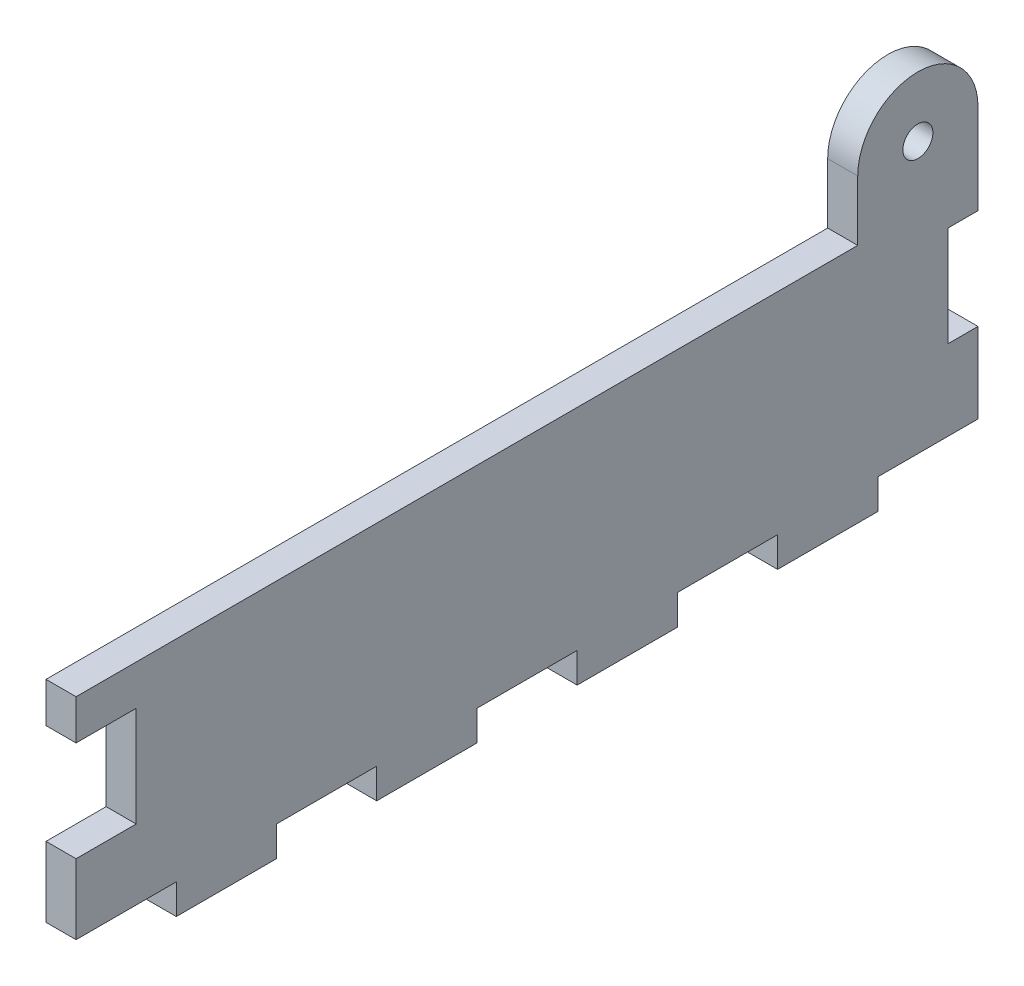
ISO-10303-21;
HEADER;
FILE_DESCRIPTION(('STEP AP214'),'2;1');
FILE_NAME('part.step','',(''),(''),'','','');
FILE_SCHEMA(('AUTOMOTIVE_DESIGN { 1 0 10303 214 1 1 1 1 }'));
ENDSEC;
DATA;
#1=APPLICATION_CONTEXT('core data for automotive mechanical design processes');
#2=APPLICATION_PROTOCOL_DEFINITION('international standard','automotive_design',2000,#1);
#3=PRODUCT_CONTEXT('',#1,'mechanical');
#4=PRODUCT('Part','Part','',(#3));
#5=PRODUCT_RELATED_PRODUCT_CATEGORY('part','',(#4));
#6=PRODUCT_DEFINITION_FORMATION('','',#4);
#7=PRODUCT_DEFINITION_CONTEXT('part definition',#1,'design');
#8=PRODUCT_DEFINITION('design','',#6,#7);
#9=PRODUCT_DEFINITION_SHAPE('','',#8);
#10=(LENGTH_UNIT() NAMED_UNIT(*) SI_UNIT(.MILLI.,.METRE.));
#11=(NAMED_UNIT(*) PLANE_ANGLE_UNIT() SI_UNIT($,.RADIAN.));
#12=(NAMED_UNIT(*) SI_UNIT($,.STERADIAN.) SOLID_ANGLE_UNIT());
#13=UNCERTAINTY_MEASURE_WITH_UNIT(LENGTH_MEASURE(1.E-05),#10,'distance_accuracy_value','');
#14=(GEOMETRIC_REPRESENTATION_CONTEXT(3) GLOBAL_UNCERTAINTY_ASSIGNED_CONTEXT((#13)) GLOBAL_UNIT_ASSIGNED_CONTEXT((#10,
#11,#12)) REPRESENTATION_CONTEXT('',''));
#15=CARTESIAN_POINT('',(0.,0.,0.));
#16=DIRECTION('',(0.,0.,1.));
#17=DIRECTION('',(1.,0.,0.));
#18=AXIS2_PLACEMENT_3D('',#15,#16,#17);
#19=CARTESIAN_POINT('',(3.,27.,-75.2773912567814));
#20=DIRECTION('',(1.,0.,0.));
#21=DIRECTION('',(0.,0.,-1.));
#22=AXIS2_PLACEMENT_3D('',#19,#20,#21);
#23=PLANE('',#22);
#24=CARTESIAN_POINT('',(3.,27.,-75.2773912567814));
#25=DIRECTION('',(1.,0.,0.));
#26=DIRECTION('',(0.,0.,-1.));
#27=AXIS2_PLACEMENT_3D('',#24,#25,#26);
#28=CIRCLE('',#27,6.);
#29=CARTESIAN_POINT('',(3.,27.,-81.2773912567814));
#30=VERTEX_POINT('',#29);
#31=CARTESIAN_POINT('',(3.,27.,-69.2773912567814));
#32=VERTEX_POINT('',#31);
#33=EDGE_CURVE('E327',#30,#32,#28,.T.);
#34=ORIENTED_EDGE('',*,*,#33,.T.);
#35=DIRECTION('',(0.,-1.,0.));
#36=VECTOR('',#35,1.);
#37=CARTESIAN_POINT('',(3.,21.,-69.2773912567814));
#38=LINE('',#37,#36);
#39=CARTESIAN_POINT('',(3.,21.,-69.2773912567814));
#40=VERTEX_POINT('',#39);
#41=EDGE_CURVE('E161',#32,#40,#38,.T.);
#42=ORIENTED_EDGE('',*,*,#41,.T.);
#43=DIRECTION('',(0.,0.,1.));
#44=VECTOR('',#43,1.);
#45=CARTESIAN_POINT('',(3.,21.,8.72260874321858));
#46=LINE('',#45,#44);
#47=CARTESIAN_POINT('',(3.,21.,8.72260874321858));
#48=VERTEX_POINT('',#47);
#49=EDGE_CURVE('E408',#40,#48,#46,.T.);
#50=ORIENTED_EDGE('',*,*,#49,.T.);
#51=DIRECTION('',(0.,-1.,0.));
#52=VECTOR('',#51,1.);
#53=CARTESIAN_POINT('',(3.,21.,8.72260874321858));
#54=LINE('',#53,#52);
#55=CARTESIAN_POINT('',(3.,17.,8.72260874321859));
#56=VERTEX_POINT('',#55);
#57=EDGE_CURVE('E425',#48,#56,#54,.T.);
#58=ORIENTED_EDGE('',*,*,#57,.T.);
#59=DIRECTION('',(0.,0.,-1.));
#60=VECTOR('',#59,1.);
#61=CARTESIAN_POINT('',(3.,17.,2.72260874321859));
#62=LINE('',#61,#60);
#63=CARTESIAN_POINT('',(3.,17.,2.72260874321859));
#64=VERTEX_POINT('',#63);
#65=EDGE_CURVE('E422',#56,#64,#62,.T.);
#66=ORIENTED_EDGE('',*,*,#65,.T.);
#67=DIRECTION('',(0.,-1.,0.));
#68=VECTOR('',#67,1.);
#69=CARTESIAN_POINT('',(3.,7.,2.72260874321859));
#70=LINE('',#69,#68);
#71=CARTESIAN_POINT('',(3.,7.,2.72260874321859));
#72=VERTEX_POINT('',#71);
#73=EDGE_CURVE('E424',#64,#72,#70,.T.);
#74=ORIENTED_EDGE('',*,*,#73,.T.);
#75=DIRECTION('',(0.,0.,1.));
#76=VECTOR('',#75,1.);
#77=CARTESIAN_POINT('',(3.,7.,2.72260874321859));
#78=LINE('',#77,#76);
#79=CARTESIAN_POINT('',(3.,7.,8.72260874321859));
#80=VERTEX_POINT('',#79);
#81=EDGE_CURVE('E427',#72,#80,#78,.T.);
#82=ORIENTED_EDGE('',*,*,#81,.T.);
#83=DIRECTION('',(0.,-1.,0.));
#84=VECTOR('',#83,1.);
#85=CARTESIAN_POINT('',(3.,7.,8.72260874321859));
#86=LINE('',#85,#84);
#87=CARTESIAN_POINT('',(3.,0.,8.72260874321858));
#88=VERTEX_POINT('',#87);
#89=EDGE_CURVE('E433',#80,#88,#86,.T.);
#90=ORIENTED_EDGE('',*,*,#89,.T.);
#91=DIRECTION('',(0.,0.,-1.));
#92=VECTOR('',#91,1.);
#93=CARTESIAN_POINT('',(3.,0.,8.72260874321858));
#94=LINE('',#93,#92);
#95=CARTESIAN_POINT('',(3.,0.,-1.27739125678141));
#96=VERTEX_POINT('',#95);
#97=EDGE_CURVE('E435',#88,#96,#94,.T.);
#98=ORIENTED_EDGE('',*,*,#97,.T.);
#99=DIRECTION('',(0.,-1.,0.));
#100=VECTOR('',#99,1.);
#101=CARTESIAN_POINT('',(3.,0.,-1.27739125678141));
#102=LINE('',#101,#100);
#103=CARTESIAN_POINT('',(3.,-3.,-1.27739125678141));
#104=VERTEX_POINT('',#103);
#105=EDGE_CURVE('E437',#96,#104,#102,.T.);
#106=ORIENTED_EDGE('',*,*,#105,.T.);
#107=DIRECTION('',(0.,0.,-1.));
#108=VECTOR('',#107,1.);
#109=CARTESIAN_POINT('',(3.,-3.,-1.27739125678141));
#110=LINE('',#109,#108);
#111=CARTESIAN_POINT('',(3.,-3.,-11.2773912567814));
#112=VERTEX_POINT('',#111);
#113=EDGE_CURVE('E439',#104,#112,#110,.T.);
#114=ORIENTED_EDGE('',*,*,#113,.T.);
#115=DIRECTION('',(0.,1.,0.));
#116=VECTOR('',#115,1.);
#117=CARTESIAN_POINT('',(3.,0.,-11.2773912567814));
#118=LINE('',#117,#116);
#119=CARTESIAN_POINT('',(3.,0.,-11.2773912567814));
#120=VERTEX_POINT('',#119);
#121=EDGE_CURVE('E441',#112,#120,#118,.T.);
#122=ORIENTED_EDGE('',*,*,#121,.T.);
#123=DIRECTION('',(0.,0.,-1.));
#124=VECTOR('',#123,1.);
#125=CARTESIAN_POINT('',(3.,0.,-11.2773912567814));
#126=LINE('',#125,#124);
#127=CARTESIAN_POINT('',(3.,0.,-21.2773912567814));
#128=VERTEX_POINT('',#127);
#129=EDGE_CURVE('E443',#120,#128,#126,.T.);
#130=ORIENTED_EDGE('',*,*,#129,.T.);
#131=DIRECTION('',(0.,-1.,0.));
#132=VECTOR('',#131,1.);
#133=CARTESIAN_POINT('',(3.,0.,-21.2773912567814));
#134=LINE('',#133,#132);
#135=CARTESIAN_POINT('',(3.,-3.,-21.2773912567814));
#136=VERTEX_POINT('',#135);
#137=EDGE_CURVE('E445',#128,#136,#134,.T.);
#138=ORIENTED_EDGE('',*,*,#137,.T.);
#139=DIRECTION('',(0.,0.,-1.));
#140=VECTOR('',#139,1.);
#141=CARTESIAN_POINT('',(3.,-3.,-21.2773912567814));
#142=LINE('',#141,#140);
#143=CARTESIAN_POINT('',(3.,-3.,-31.2773912567814));
#144=VERTEX_POINT('',#143);
#145=EDGE_CURVE('E447',#136,#144,#142,.T.);
#146=ORIENTED_EDGE('',*,*,#145,.T.);
#147=DIRECTION('',(0.,1.,0.));
#148=VECTOR('',#147,1.);
#149=CARTESIAN_POINT('',(3.,0.,-31.2773912567814));
#150=LINE('',#149,#148);
#151=CARTESIAN_POINT('',(3.,0.,-31.2773912567814));
#152=VERTEX_POINT('',#151);
#153=EDGE_CURVE('E449',#144,#152,#150,.T.);
#154=ORIENTED_EDGE('',*,*,#153,.T.);
#155=DIRECTION('',(0.,0.,-1.));
#156=VECTOR('',#155,1.);
#157=CARTESIAN_POINT('',(3.,0.,-31.2773912567814));
#158=LINE('',#157,#156);
#159=CARTESIAN_POINT('',(3.,0.,-41.2773912567814));
#160=VERTEX_POINT('',#159);
#161=EDGE_CURVE('E451',#152,#160,#158,.T.);
#162=ORIENTED_EDGE('',*,*,#161,.T.);
#163=DIRECTION('',(0.,-1.,0.));
#164=VECTOR('',#163,1.);
#165=CARTESIAN_POINT('',(3.,0.,-41.2773912567814));
#166=LINE('',#165,#164);
#167=CARTESIAN_POINT('',(3.,-3.,-41.2773912567814));
#168=VERTEX_POINT('',#167);
#169=EDGE_CURVE('E453',#160,#168,#166,.T.);
#170=ORIENTED_EDGE('',*,*,#169,.T.);
#171=DIRECTION('',(0.,0.,-1.));
#172=VECTOR('',#171,1.);
#173=CARTESIAN_POINT('',(3.,-3.,-41.2773912567814));
#174=LINE('',#173,#172);
#175=CARTESIAN_POINT('',(3.,-3.,-51.2773912567814));
#176=VERTEX_POINT('',#175);
#177=EDGE_CURVE('E455',#168,#176,#174,.T.);
#178=ORIENTED_EDGE('',*,*,#177,.T.);
#179=DIRECTION('',(0.,1.,0.));
#180=VECTOR('',#179,1.);
#181=CARTESIAN_POINT('',(3.,0.,-51.2773912567814));
#182=LINE('',#181,#180);
#183=CARTESIAN_POINT('',(3.,0.,-51.2773912567814));
#184=VERTEX_POINT('',#183);
#185=EDGE_CURVE('E457',#176,#184,#182,.T.);
#186=ORIENTED_EDGE('',*,*,#185,.T.);
#187=DIRECTION('',(0.,0.,-1.));
#188=VECTOR('',#187,1.);
#189=CARTESIAN_POINT('',(3.,0.,-51.2773912567814));
#190=LINE('',#189,#188);
#191=CARTESIAN_POINT('',(3.,0.,-61.2773912567814));
#192=VERTEX_POINT('',#191);
#193=EDGE_CURVE('E459',#184,#192,#190,.T.);
#194=ORIENTED_EDGE('',*,*,#193,.T.);
#195=DIRECTION('',(0.,-1.,0.));
#196=VECTOR('',#195,1.);
#197=CARTESIAN_POINT('',(3.,0.,-61.2773912567814));
#198=LINE('',#197,#196);
#199=CARTESIAN_POINT('',(3.,-3.,-61.2773912567814));
#200=VERTEX_POINT('',#199);
#201=EDGE_CURVE('E461',#192,#200,#198,.T.);
#202=ORIENTED_EDGE('',*,*,#201,.T.);
#203=DIRECTION('',(0.,0.,-1.));
#204=VECTOR('',#203,1.);
#205=CARTESIAN_POINT('',(3.,-3.,-61.2773912567814));
#206=LINE('',#205,#204);
#207=CARTESIAN_POINT('',(3.,-3.,-71.2773912567814));
#208=VERTEX_POINT('',#207);
#209=EDGE_CURVE('E463',#200,#208,#206,.T.);
#210=ORIENTED_EDGE('',*,*,#209,.T.);
#211=DIRECTION('',(0.,1.,0.));
#212=VECTOR('',#211,1.);
#213=CARTESIAN_POINT('',(3.,0.,-71.2773912567814));
#214=LINE('',#213,#212);
#215=CARTESIAN_POINT('',(3.,0.,-71.2773912567814));
#216=VERTEX_POINT('',#215);
#217=EDGE_CURVE('E465',#208,#216,#214,.T.);
#218=ORIENTED_EDGE('',*,*,#217,.T.);
#219=DIRECTION('',(0.,0.,-1.));
#220=VECTOR('',#219,1.);
#221=CARTESIAN_POINT('',(3.,0.,-71.2773912567814));
#222=LINE('',#221,#220);
#223=CARTESIAN_POINT('',(3.,0.,-81.2773912567814));
#224=VERTEX_POINT('',#223);
#225=EDGE_CURVE('E467',#216,#224,#222,.T.);
#226=ORIENTED_EDGE('',*,*,#225,.T.);
#227=DIRECTION('',(0.,1.,0.));
#228=VECTOR('',#227,1.);
#229=CARTESIAN_POINT('',(3.,8.,-81.2773912567814));
#230=LINE('',#229,#228);
#231=CARTESIAN_POINT('',(3.,8.,-81.2773912567814));
#232=VERTEX_POINT('',#231);
#233=EDGE_CURVE('E469',#224,#232,#230,.T.);
#234=ORIENTED_EDGE('',*,*,#233,.T.);
#235=DIRECTION('',(0.,0.,1.));
#236=VECTOR('',#235,1.);
#237=CARTESIAN_POINT('',(3.,8.,-81.2773912567814));
#238=LINE('',#237,#236);
#239=CARTESIAN_POINT('',(3.,8.,-78.2773912567814));
#240=VERTEX_POINT('',#239);
#241=EDGE_CURVE('E247',#232,#240,#238,.T.);
#242=ORIENTED_EDGE('',*,*,#241,.T.);
#243=DIRECTION('',(0.,1.,0.));
#244=VECTOR('',#243,1.);
#245=CARTESIAN_POINT('',(3.,18.,-78.2773912567814));
#246=LINE('',#245,#244);
#247=CARTESIAN_POINT('',(3.,18.,-78.2773912567814));
#248=VERTEX_POINT('',#247);
#249=EDGE_CURVE('E240',#240,#248,#246,.T.);
#250=ORIENTED_EDGE('',*,*,#249,.T.);
#251=DIRECTION('',(0.,0.,-1.));
#252=VECTOR('',#251,1.);
#253=CARTESIAN_POINT('',(3.,18.,-81.2773912567814));
#254=LINE('',#253,#252);
#255=CARTESIAN_POINT('',(3.,18.,-81.2773912567814));
#256=VERTEX_POINT('',#255);
#257=EDGE_CURVE('E244',#248,#256,#254,.T.);
#258=ORIENTED_EDGE('',*,*,#257,.T.);
#259=DIRECTION('',(0.,1.,0.));
#260=VECTOR('',#259,1.);
#261=CARTESIAN_POINT('',(3.,21.,-81.2773912567814));
#262=LINE('',#261,#260);
#263=EDGE_CURVE('E54',#256,#30,#262,.T.);
#264=ORIENTED_EDGE('',*,*,#263,.T.);
#265=EDGE_LOOP('',(#34,#42,#50,#58,#66,#74,#82,#90,#98,#106,#114,#122,#130,#138,#146,#154,#162,
#170,#178,#186,#194,#202,#210,#218,#226,#234,#242,#250,#258,#264));
#266=FACE_BOUND('',#265,.T.);
#267=CARTESIAN_POINT('',(3.,27.,-75.2773912567814));
#268=DIRECTION('',(1.,0.,0.));
#269=DIRECTION('',(0.,0.,-1.));
#270=AXIS2_PLACEMENT_3D('',#267,#268,#269);
#271=CIRCLE('',#270,1.5);
#272=CARTESIAN_POINT('',(3.,27.,-76.7773912567814));
#273=VERTEX_POINT('',#272);
#274=EDGE_CURVE('E271',#273,#273,#271,.T.);
#275=ORIENTED_EDGE('',*,*,#274,.F.);
#276=EDGE_LOOP('',(#275));
#277=FACE_BOUND('',#276,.T.);
#278=ADVANCED_FACE('F37',(#266,#277),#23,.T.);
#279=CARTESIAN_POINT('',(0.,27.,-75.2773912567814));
#280=DIRECTION('',(1.,0.,0.));
#281=DIRECTION('',(0.,0.,-1.));
#282=AXIS2_PLACEMENT_3D('',#279,#280,#281);
#283=PLANE('',#282);
#284=CARTESIAN_POINT('',(0.,27.,-75.2773912567814));
#285=DIRECTION('',(1.,0.,0.));
#286=DIRECTION('',(0.,0.,-1.));
#287=AXIS2_PLACEMENT_3D('',#284,#285,#286);
#288=CIRCLE('',#287,6.);
#289=CARTESIAN_POINT('',(0.,27.,-81.2773912567814));
#290=VERTEX_POINT('',#289);
#291=CARTESIAN_POINT('',(0.,27.,-69.2773912567814));
#292=VERTEX_POINT('',#291);
#293=EDGE_CURVE('E267',#290,#292,#288,.T.);
#294=ORIENTED_EDGE('',*,*,#293,.F.);
#295=DIRECTION('',(0.,1.,0.));
#296=VECTOR('',#295,1.);
#297=CARTESIAN_POINT('',(0.,21.,-81.2773912567814));
#298=LINE('',#297,#296);
#299=CARTESIAN_POINT('',(0.,18.,-81.2773912567814));
#300=VERTEX_POINT('',#299);
#301=EDGE_CURVE('E149',#300,#290,#298,.T.);
#302=ORIENTED_EDGE('',*,*,#301,.F.);
#303=DIRECTION('',(0.,0.,-1.));
#304=VECTOR('',#303,1.);
#305=CARTESIAN_POINT('',(0.,18.,-81.2773912567814));
#306=LINE('',#305,#304);
#307=CARTESIAN_POINT('',(0.,18.,-78.2773912567814));
#308=VERTEX_POINT('',#307);
#309=EDGE_CURVE('E324',#308,#300,#306,.T.);
#310=ORIENTED_EDGE('',*,*,#309,.F.);
#311=DIRECTION('',(0.,1.,0.));
#312=VECTOR('',#311,1.);
#313=CARTESIAN_POINT('',(0.,18.,-78.2773912567814));
#314=LINE('',#313,#312);
#315=CARTESIAN_POINT('',(0.,8.,-78.2773912567814));
#316=VERTEX_POINT('',#315);
#317=EDGE_CURVE('E256',#316,#308,#314,.T.);
#318=ORIENTED_EDGE('',*,*,#317,.F.);
#319=DIRECTION('',(0.,0.,1.));
#320=VECTOR('',#319,1.);
#321=CARTESIAN_POINT('',(0.,8.,-81.2773912567814));
#322=LINE('',#321,#320);
#323=CARTESIAN_POINT('',(0.,8.,-81.2773912567814));
#324=VERTEX_POINT('',#323);
#325=EDGE_CURVE('E321',#324,#316,#322,.T.);
#326=ORIENTED_EDGE('',*,*,#325,.F.);
#327=DIRECTION('',(0.,1.,0.));
#328=VECTOR('',#327,1.);
#329=CARTESIAN_POINT('',(0.,8.,-81.2773912567814));
#330=LINE('',#329,#328);
#331=CARTESIAN_POINT('',(0.,0.,-81.2773912567814));
#332=VERTEX_POINT('',#331);
#333=EDGE_CURVE('E319',#332,#324,#330,.T.);
#334=ORIENTED_EDGE('',*,*,#333,.F.);
#335=DIRECTION('',(0.,0.,-1.));
#336=VECTOR('',#335,1.);
#337=CARTESIAN_POINT('',(0.,0.,-71.2773912567814));
#338=LINE('',#337,#336);
#339=CARTESIAN_POINT('',(0.,0.,-71.2773912567814));
#340=VERTEX_POINT('',#339);
#341=EDGE_CURVE('E317',#340,#332,#338,.T.);
#342=ORIENTED_EDGE('',*,*,#341,.F.);
#343=DIRECTION('',(0.,1.,0.));
#344=VECTOR('',#343,1.);
#345=CARTESIAN_POINT('',(0.,0.,-71.2773912567814));
#346=LINE('',#345,#344);
#347=CARTESIAN_POINT('',(0.,-3.,-71.2773912567814));
#348=VERTEX_POINT('',#347);
#349=EDGE_CURVE('E315',#348,#340,#346,.T.);
#350=ORIENTED_EDGE('',*,*,#349,.F.);
#351=DIRECTION('',(0.,0.,-1.));
#352=VECTOR('',#351,1.);
#353=CARTESIAN_POINT('',(0.,-3.,-61.2773912567814));
#354=LINE('',#353,#352);
#355=CARTESIAN_POINT('',(0.,-3.,-61.2773912567814));
#356=VERTEX_POINT('',#355);
#357=EDGE_CURVE('E313',#356,#348,#354,.T.);
#358=ORIENTED_EDGE('',*,*,#357,.F.);
#359=DIRECTION('',(0.,-1.,0.));
#360=VECTOR('',#359,1.);
#361=CARTESIAN_POINT('',(0.,0.,-61.2773912567814));
#362=LINE('',#361,#360);
#363=CARTESIAN_POINT('',(0.,0.,-61.2773912567814));
#364=VERTEX_POINT('',#363);
#365=EDGE_CURVE('E311',#364,#356,#362,.T.);
#366=ORIENTED_EDGE('',*,*,#365,.F.);
#367=DIRECTION('',(0.,0.,-1.));
#368=VECTOR('',#367,1.);
#369=CARTESIAN_POINT('',(0.,0.,-51.2773912567814));
#370=LINE('',#369,#368);
#371=CARTESIAN_POINT('',(0.,0.,-51.2773912567814));
#372=VERTEX_POINT('',#371);
#373=EDGE_CURVE('E309',#372,#364,#370,.T.);
#374=ORIENTED_EDGE('',*,*,#373,.F.);
#375=DIRECTION('',(0.,1.,0.));
#376=VECTOR('',#375,1.);
#377=CARTESIAN_POINT('',(0.,0.,-51.2773912567814));
#378=LINE('',#377,#376);
#379=CARTESIAN_POINT('',(0.,-3.,-51.2773912567814));
#380=VERTEX_POINT('',#379);
#381=EDGE_CURVE('E307',#380,#372,#378,.T.);
#382=ORIENTED_EDGE('',*,*,#381,.F.);
#383=DIRECTION('',(0.,0.,-1.));
#384=VECTOR('',#383,1.);
#385=CARTESIAN_POINT('',(0.,-3.,-41.2773912567814));
#386=LINE('',#385,#384);
#387=CARTESIAN_POINT('',(0.,-3.,-41.2773912567814));
#388=VERTEX_POINT('',#387);
#389=EDGE_CURVE('E305',#388,#380,#386,.T.);
#390=ORIENTED_EDGE('',*,*,#389,.F.);
#391=DIRECTION('',(0.,-1.,0.));
#392=VECTOR('',#391,1.);
#393=CARTESIAN_POINT('',(0.,0.,-41.2773912567814));
#394=LINE('',#393,#392);
#395=CARTESIAN_POINT('',(0.,0.,-41.2773912567814));
#396=VERTEX_POINT('',#395);
#397=EDGE_CURVE('E303',#396,#388,#394,.T.);
#398=ORIENTED_EDGE('',*,*,#397,.F.);
#399=DIRECTION('',(0.,0.,-1.));
#400=VECTOR('',#399,1.);
#401=CARTESIAN_POINT('',(0.,0.,-31.2773912567814));
#402=LINE('',#401,#400);
#403=CARTESIAN_POINT('',(0.,0.,-31.2773912567814));
#404=VERTEX_POINT('',#403);
#405=EDGE_CURVE('E301',#404,#396,#402,.T.);
#406=ORIENTED_EDGE('',*,*,#405,.F.);
#407=DIRECTION('',(0.,1.,0.));
#408=VECTOR('',#407,1.);
#409=CARTESIAN_POINT('',(0.,0.,-31.2773912567814));
#410=LINE('',#409,#408);
#411=CARTESIAN_POINT('',(0.,-3.,-31.2773912567814));
#412=VERTEX_POINT('',#411);
#413=EDGE_CURVE('E299',#412,#404,#410,.T.);
#414=ORIENTED_EDGE('',*,*,#413,.F.);
#415=DIRECTION('',(0.,0.,-1.));
#416=VECTOR('',#415,1.);
#417=CARTESIAN_POINT('',(0.,-3.,-21.2773912567814));
#418=LINE('',#417,#416);
#419=CARTESIAN_POINT('',(0.,-3.,-21.2773912567814));
#420=VERTEX_POINT('',#419);
#421=EDGE_CURVE('E297',#420,#412,#418,.T.);
#422=ORIENTED_EDGE('',*,*,#421,.F.);
#423=DIRECTION('',(0.,-1.,0.));
#424=VECTOR('',#423,1.);
#425=CARTESIAN_POINT('',(0.,0.,-21.2773912567814));
#426=LINE('',#425,#424);
#427=CARTESIAN_POINT('',(0.,0.,-21.2773912567814));
#428=VERTEX_POINT('',#427);
#429=EDGE_CURVE('E295',#428,#420,#426,.T.);
#430=ORIENTED_EDGE('',*,*,#429,.F.);
#431=DIRECTION('',(0.,0.,-1.));
#432=VECTOR('',#431,1.);
#433=CARTESIAN_POINT('',(0.,0.,-11.2773912567814));
#434=LINE('',#433,#432);
#435=CARTESIAN_POINT('',(0.,0.,-11.2773912567814));
#436=VERTEX_POINT('',#435);
#437=EDGE_CURVE('E293',#436,#428,#434,.T.);
#438=ORIENTED_EDGE('',*,*,#437,.F.);
#439=DIRECTION('',(0.,1.,0.));
#440=VECTOR('',#439,1.);
#441=CARTESIAN_POINT('',(0.,0.,-11.2773912567814));
#442=LINE('',#441,#440);
#443=CARTESIAN_POINT('',(0.,-3.,-11.2773912567814));
#444=VERTEX_POINT('',#443);
#445=EDGE_CURVE('E291',#444,#436,#442,.T.);
#446=ORIENTED_EDGE('',*,*,#445,.F.);
#447=DIRECTION('',(0.,0.,-1.));
#448=VECTOR('',#447,1.);
#449=CARTESIAN_POINT('',(0.,-3.,-1.27739125678141));
#450=LINE('',#449,#448);
#451=CARTESIAN_POINT('',(0.,-3.,-1.27739125678141));
#452=VERTEX_POINT('',#451);
#453=EDGE_CURVE('E289',#452,#444,#450,.T.);
#454=ORIENTED_EDGE('',*,*,#453,.F.);
#455=DIRECTION('',(0.,-1.,0.));
#456=VECTOR('',#455,1.);
#457=CARTESIAN_POINT('',(0.,0.,-1.27739125678141));
#458=LINE('',#457,#456);
#459=CARTESIAN_POINT('',(0.,0.,-1.27739125678141));
#460=VERTEX_POINT('',#459);
#461=EDGE_CURVE('E287',#460,#452,#458,.T.);
#462=ORIENTED_EDGE('',*,*,#461,.F.);
#463=DIRECTION('',(0.,0.,-1.));
#464=VECTOR('',#463,1.);
#465=CARTESIAN_POINT('',(0.,0.,8.72260874321858));
#466=LINE('',#465,#464);
#467=CARTESIAN_POINT('',(0.,0.,8.72260874321858));
#468=VERTEX_POINT('',#467);
#469=EDGE_CURVE('E285',#468,#460,#466,.T.);
#470=ORIENTED_EDGE('',*,*,#469,.F.);
#471=DIRECTION('',(0.,-1.,0.));
#472=VECTOR('',#471,1.);
#473=CARTESIAN_POINT('',(0.,7.,8.72260874321859));
#474=LINE('',#473,#472);
#475=CARTESIAN_POINT('',(0.,7.,8.72260874321859));
#476=VERTEX_POINT('',#475);
#477=EDGE_CURVE('E283',#476,#468,#474,.T.);
#478=ORIENTED_EDGE('',*,*,#477,.F.);
#479=DIRECTION('',(0.,0.,1.));
#480=VECTOR('',#479,1.);
#481=CARTESIAN_POINT('',(0.,7.,2.72260874321859));
#482=LINE('',#481,#480);
#483=CARTESIAN_POINT('',(0.,7.,2.72260874321859));
#484=VERTEX_POINT('',#483);
#485=EDGE_CURVE('E281',#484,#476,#482,.T.);
#486=ORIENTED_EDGE('',*,*,#485,.F.);
#487=DIRECTION('',(0.,-1.,0.));
#488=VECTOR('',#487,1.);
#489=CARTESIAN_POINT('',(0.,7.,2.72260874321859));
#490=LINE('',#489,#488);
#491=CARTESIAN_POINT('',(0.,17.,2.72260874321859));
#492=VERTEX_POINT('',#491);
#493=EDGE_CURVE('E279',#492,#484,#490,.T.);
#494=ORIENTED_EDGE('',*,*,#493,.F.);
#495=DIRECTION('',(0.,0.,-1.));
#496=VECTOR('',#495,1.);
#497=CARTESIAN_POINT('',(0.,17.,2.72260874321859));
#498=LINE('',#497,#496);
#499=CARTESIAN_POINT('',(0.,17.,8.72260874321859));
#500=VERTEX_POINT('',#499);
#501=EDGE_CURVE('E277',#500,#492,#498,.T.);
#502=ORIENTED_EDGE('',*,*,#501,.F.);
#503=DIRECTION('',(0.,-1.,0.));
#504=VECTOR('',#503,1.);
#505=CARTESIAN_POINT('',(0.,21.,8.72260874321858));
#506=LINE('',#505,#504);
#507=CARTESIAN_POINT('',(0.,21.,8.72260874321858));
#508=VERTEX_POINT('',#507);
#509=EDGE_CURVE('E275',#508,#500,#506,.T.);
#510=ORIENTED_EDGE('',*,*,#509,.F.);
#511=DIRECTION('',(0.,0.,1.));
#512=VECTOR('',#511,1.);
#513=CARTESIAN_POINT('',(0.,21.,8.72260874321858));
#514=LINE('',#513,#512);
#515=CARTESIAN_POINT('',(0.,21.,-69.2773912567814));
#516=VERTEX_POINT('',#515);
#517=EDGE_CURVE('E273',#516,#508,#514,.T.);
#518=ORIENTED_EDGE('',*,*,#517,.F.);
#519=DIRECTION('',(0.,-1.,0.));
#520=VECTOR('',#519,1.);
#521=CARTESIAN_POINT('',(0.,21.,-69.2773912567814));
#522=LINE('',#521,#520);
#523=EDGE_CURVE('E270',#292,#516,#522,.T.);
#524=ORIENTED_EDGE('',*,*,#523,.F.);
#525=EDGE_LOOP('',(#294,#302,#310,#318,#326,#334,#342,#350,#358,#366,#374,#382,#390,#398,#406,
#414,#422,#430,#438,#446,#454,#462,#470,#478,#486,#494,#502,#510,#518,#524));
#526=FACE_BOUND('',#525,.T.);
#527=CARTESIAN_POINT('',(0.,27.,-75.2773912567814));
#528=DIRECTION('',(1.,0.,0.));
#529=DIRECTION('',(0.,0.,-1.));
#530=AXIS2_PLACEMENT_3D('',#527,#528,#529);
#531=CIRCLE('',#530,1.5);
#532=CARTESIAN_POINT('',(0.,27.,-76.7773912567814));
#533=VERTEX_POINT('',#532);
#534=EDGE_CURVE('E487',#533,#533,#531,.T.);
#535=ORIENTED_EDGE('',*,*,#534,.T.);
#536=EDGE_LOOP('',(#535));
#537=FACE_BOUND('',#536,.T.);
#538=ADVANCED_FACE('F410',(#526,#537),#283,.F.);
#539=CARTESIAN_POINT('',(3.,27.,-75.2773912567814));
#540=DIRECTION('',(-1.,0.,0.));
#541=DIRECTION('',(0.,0.,1.));
#542=AXIS2_PLACEMENT_3D('',#539,#540,#541);
#543=CYLINDRICAL_SURFACE('',#542,6.);
#544=ORIENTED_EDGE('',*,*,#293,.T.);
#545=DIRECTION('',(-1.,0.,0.));
#546=VECTOR('',#545,1.);
#547=CARTESIAN_POINT('',(3.,27.,-69.2773912567814));
#548=LINE('',#547,#546);
#549=EDGE_CURVE('E11',#32,#292,#548,.T.);
#550=ORIENTED_EDGE('',*,*,#549,.F.);
#551=ORIENTED_EDGE('',*,*,#33,.F.);
#552=DIRECTION('',(-1.,0.,0.));
#553=VECTOR('',#552,1.);
#554=CARTESIAN_POINT('',(3.,27.,-81.2773912567814));
#555=LINE('',#554,#553);
#556=EDGE_CURVE('E263',#30,#290,#555,.T.);
#557=ORIENTED_EDGE('',*,*,#556,.T.);
#558=EDGE_LOOP('',(#544,#550,#551,#557));
#559=FACE_BOUND('',#558,.T.);
#560=ADVANCED_FACE('F39',(#559),#543,.T.);
#561=CARTESIAN_POINT('',(3.,21.,-69.2773912567814));
#562=DIRECTION('',(0.,0.,-1.));
#563=DIRECTION('',(-1.,0.,0.));
#564=AXIS2_PLACEMENT_3D('',#561,#562,#563);
#565=PLANE('',#564);
#566=ORIENTED_EDGE('',*,*,#523,.T.);
#567=DIRECTION('',(-1.,0.,0.));
#568=VECTOR('',#567,1.);
#569=CARTESIAN_POINT('',(3.,21.,-69.2773912567814));
#570=LINE('',#569,#568);
#571=EDGE_CURVE('E46',#40,#516,#570,.T.);
#572=ORIENTED_EDGE('',*,*,#571,.F.);
#573=ORIENTED_EDGE('',*,*,#41,.F.);
#574=ORIENTED_EDGE('',*,*,#549,.T.);
#575=EDGE_LOOP('',(#566,#572,#573,#574));
#576=FACE_BOUND('',#575,.T.);
#577=ADVANCED_FACE('F598',(#576),#565,.F.);
#578=CARTESIAN_POINT('',(3.,21.,8.72260874321858));
#579=DIRECTION('',(0.,-1.,0.));
#580=DIRECTION('',(0.,0.,-1.));
#581=AXIS2_PLACEMENT_3D('',#578,#579,#580);
#582=PLANE('',#581);
#583=ORIENTED_EDGE('',*,*,#517,.T.);
#584=DIRECTION('',(-1.,0.,0.));
#585=VECTOR('',#584,1.);
#586=CARTESIAN_POINT('',(3.,21.,8.72260874321858));
#587=LINE('',#586,#585);
#588=EDGE_CURVE('E400',#48,#508,#587,.T.);
#589=ORIENTED_EDGE('',*,*,#588,.F.);
#590=ORIENTED_EDGE('',*,*,#49,.F.);
#591=ORIENTED_EDGE('',*,*,#571,.T.);
#592=EDGE_LOOP('',(#583,#589,#590,#591));
#593=FACE_BOUND('',#592,.T.);
#594=ADVANCED_FACE('F406',(#593),#582,.F.);
#595=CARTESIAN_POINT('',(3.,21.,8.72260874321858));
#596=DIRECTION('',(0.,0.,-1.));
#597=DIRECTION('',(0.,1.,0.));
#598=AXIS2_PLACEMENT_3D('',#595,#596,#597);
#599=PLANE('',#598);
#600=ORIENTED_EDGE('',*,*,#509,.T.);
#601=DIRECTION('',(-1.,0.,0.));
#602=VECTOR('',#601,1.);
#603=CARTESIAN_POINT('',(3.,17.,8.72260874321859));
#604=LINE('',#603,#602);
#605=EDGE_CURVE('E397',#56,#500,#604,.T.);
#606=ORIENTED_EDGE('',*,*,#605,.F.);
#607=ORIENTED_EDGE('',*,*,#57,.F.);
#608=ORIENTED_EDGE('',*,*,#588,.T.);
#609=EDGE_LOOP('',(#600,#606,#607,#608));
#610=FACE_BOUND('',#609,.T.);
#611=ADVANCED_FACE('F416',(#610),#599,.F.);
#612=CARTESIAN_POINT('',(3.,17.,2.72260874321859));
#613=DIRECTION('',(0.,1.,0.));
#614=DIRECTION('',(0.,0.,1.));
#615=AXIS2_PLACEMENT_3D('',#612,#613,#614);
#616=PLANE('',#615);
#617=ORIENTED_EDGE('',*,*,#501,.T.);
#618=DIRECTION('',(-1.,0.,0.));
#619=VECTOR('',#618,1.);
#620=CARTESIAN_POINT('',(3.,17.,2.72260874321859));
#621=LINE('',#620,#619);
#622=EDGE_CURVE('E394',#64,#492,#621,.T.);
#623=ORIENTED_EDGE('',*,*,#622,.F.);
#624=ORIENTED_EDGE('',*,*,#65,.F.);
#625=ORIENTED_EDGE('',*,*,#605,.T.);
#626=EDGE_LOOP('',(#617,#623,#624,#625));
#627=FACE_BOUND('',#626,.T.);
#628=ADVANCED_FACE('F420',(#627),#616,.F.);
#629=CARTESIAN_POINT('',(3.,7.,2.72260874321859));
#630=DIRECTION('',(0.,0.,-1.));
#631=DIRECTION('',(-1.,0.,0.));
#632=AXIS2_PLACEMENT_3D('',#629,#630,#631);
#633=PLANE('',#632);
#634=ORIENTED_EDGE('',*,*,#493,.T.);
#635=DIRECTION('',(-1.,0.,0.));
#636=VECTOR('',#635,1.);
#637=CARTESIAN_POINT('',(3.,7.,2.72260874321859));
#638=LINE('',#637,#636);
#639=EDGE_CURVE('E391',#72,#484,#638,.T.);
#640=ORIENTED_EDGE('',*,*,#639,.F.);
#641=ORIENTED_EDGE('',*,*,#73,.F.);
#642=ORIENTED_EDGE('',*,*,#622,.T.);
#643=EDGE_LOOP('',(#634,#640,#641,#642));
#644=FACE_BOUND('',#643,.T.);
#645=ADVANCED_FACE('F588',(#644),#633,.F.);
#646=CARTESIAN_POINT('',(3.,7.,2.72260874321859));
#647=DIRECTION('',(0.,-1.,0.));
#648=DIRECTION('',(0.,0.,-1.));
#649=AXIS2_PLACEMENT_3D('',#646,#647,#648);
#650=PLANE('',#649);
#651=ORIENTED_EDGE('',*,*,#485,.T.);
#652=DIRECTION('',(-1.,0.,0.));
#653=VECTOR('',#652,1.);
#654=CARTESIAN_POINT('',(3.,7.,8.72260874321859));
#655=LINE('',#654,#653);
#656=EDGE_CURVE('E388',#80,#476,#655,.T.);
#657=ORIENTED_EDGE('',*,*,#656,.F.);
#658=ORIENTED_EDGE('',*,*,#81,.F.);
#659=ORIENTED_EDGE('',*,*,#639,.T.);
#660=EDGE_LOOP('',(#651,#657,#658,#659));
#661=FACE_BOUND('',#660,.T.);
#662=ADVANCED_FACE('F584',(#661),#650,.F.);
#663=CARTESIAN_POINT('',(3.,7.,8.72260874321859));
#664=DIRECTION('',(0.,0.,-1.));
#665=DIRECTION('',(0.,1.,0.));
#666=AXIS2_PLACEMENT_3D('',#663,#664,#665);
#667=PLANE('',#666);
#668=ORIENTED_EDGE('',*,*,#477,.T.);
#669=DIRECTION('',(-1.,0.,0.));
#670=VECTOR('',#669,1.);
#671=CARTESIAN_POINT('',(3.,0.,8.72260874321858));
#672=LINE('',#671,#670);
#673=EDGE_CURVE('E385',#88,#468,#672,.T.);
#674=ORIENTED_EDGE('',*,*,#673,.F.);
#675=ORIENTED_EDGE('',*,*,#89,.F.);
#676=ORIENTED_EDGE('',*,*,#656,.T.);
#677=EDGE_LOOP('',(#668,#674,#675,#676));
#678=FACE_BOUND('',#677,.T.);
#679=ADVANCED_FACE('F580',(#678),#667,.F.);
#680=CARTESIAN_POINT('',(3.,0.,8.72260874321858));
#681=DIRECTION('',(0.,1.,0.));
#682=DIRECTION('',(0.,0.,1.));
#683=AXIS2_PLACEMENT_3D('',#680,#681,#682);
#684=PLANE('',#683);
#685=ORIENTED_EDGE('',*,*,#469,.T.);
#686=DIRECTION('',(-1.,0.,0.));
#687=VECTOR('',#686,1.);
#688=CARTESIAN_POINT('',(3.,0.,-1.27739125678141));
#689=LINE('',#688,#687);
#690=EDGE_CURVE('E382',#96,#460,#689,.T.);
#691=ORIENTED_EDGE('',*,*,#690,.F.);
#692=ORIENTED_EDGE('',*,*,#97,.F.);
#693=ORIENTED_EDGE('',*,*,#673,.T.);
#694=EDGE_LOOP('',(#685,#691,#692,#693));
#695=FACE_BOUND('',#694,.T.);
#696=ADVANCED_FACE('F576',(#695),#684,.F.);
#697=CARTESIAN_POINT('',(3.,0.,-1.27739125678141));
#698=DIRECTION('',(0.,0.,-1.));
#699=DIRECTION('',(0.,1.,0.));
#700=AXIS2_PLACEMENT_3D('',#697,#698,#699);
#701=PLANE('',#700);
#702=ORIENTED_EDGE('',*,*,#461,.T.);
#703=DIRECTION('',(-1.,0.,0.));
#704=VECTOR('',#703,1.);
#705=CARTESIAN_POINT('',(3.,-3.,-1.27739125678141));
#706=LINE('',#705,#704);
#707=EDGE_CURVE('E379',#104,#452,#706,.T.);
#708=ORIENTED_EDGE('',*,*,#707,.F.);
#709=ORIENTED_EDGE('',*,*,#105,.F.);
#710=ORIENTED_EDGE('',*,*,#690,.T.);
#711=EDGE_LOOP('',(#702,#708,#709,#710));
#712=FACE_BOUND('',#711,.T.);
#713=ADVANCED_FACE('F572',(#712),#701,.F.);
#714=CARTESIAN_POINT('',(3.,-3.,-1.27739125678141));
#715=DIRECTION('',(0.,1.,0.));
#716=DIRECTION('',(0.,0.,1.));
#717=AXIS2_PLACEMENT_3D('',#714,#715,#716);
#718=PLANE('',#717);
#719=ORIENTED_EDGE('',*,*,#453,.T.);
#720=DIRECTION('',(-1.,0.,0.));
#721=VECTOR('',#720,1.);
#722=CARTESIAN_POINT('',(3.,-3.,-11.2773912567814));
#723=LINE('',#722,#721);
#724=EDGE_CURVE('E376',#112,#444,#723,.T.);
#725=ORIENTED_EDGE('',*,*,#724,.F.);
#726=ORIENTED_EDGE('',*,*,#113,.F.);
#727=ORIENTED_EDGE('',*,*,#707,.T.);
#728=EDGE_LOOP('',(#719,#725,#726,#727));
#729=FACE_BOUND('',#728,.T.);
#730=ADVANCED_FACE('F568',(#729),#718,.F.);
#731=CARTESIAN_POINT('',(3.,0.,-11.2773912567814));
#732=DIRECTION('',(0.,0.,1.));
#733=DIRECTION('',(1.,0.,0.));
#734=AXIS2_PLACEMENT_3D('',#731,#732,#733);
#735=PLANE('',#734);
#736=ORIENTED_EDGE('',*,*,#445,.T.);
#737=DIRECTION('',(-1.,0.,0.));
#738=VECTOR('',#737,1.);
#739=CARTESIAN_POINT('',(3.,0.,-11.2773912567814));
#740=LINE('',#739,#738);
#741=EDGE_CURVE('E373',#120,#436,#740,.T.);
#742=ORIENTED_EDGE('',*,*,#741,.F.);
#743=ORIENTED_EDGE('',*,*,#121,.F.);
#744=ORIENTED_EDGE('',*,*,#724,.T.);
#745=EDGE_LOOP('',(#736,#742,#743,#744));
#746=FACE_BOUND('',#745,.T.);
#747=ADVANCED_FACE('F564',(#746),#735,.F.);
#748=CARTESIAN_POINT('',(3.,0.,-11.2773912567814));
#749=DIRECTION('',(0.,1.,0.));
#750=DIRECTION('',(0.,0.,1.));
#751=AXIS2_PLACEMENT_3D('',#748,#749,#750);
#752=PLANE('',#751);
#753=ORIENTED_EDGE('',*,*,#437,.T.);
#754=DIRECTION('',(-1.,0.,0.));
#755=VECTOR('',#754,1.);
#756=CARTESIAN_POINT('',(3.,0.,-21.2773912567814));
#757=LINE('',#756,#755);
#758=EDGE_CURVE('E370',#128,#428,#757,.T.);
#759=ORIENTED_EDGE('',*,*,#758,.F.);
#760=ORIENTED_EDGE('',*,*,#129,.F.);
#761=ORIENTED_EDGE('',*,*,#741,.T.);
#762=EDGE_LOOP('',(#753,#759,#760,#761));
#763=FACE_BOUND('',#762,.T.);
#764=ADVANCED_FACE('F560',(#763),#752,.F.);
#765=CARTESIAN_POINT('',(3.,0.,-21.2773912567814));
#766=DIRECTION('',(0.,0.,-1.));
#767=DIRECTION('',(-1.,0.,0.));
#768=AXIS2_PLACEMENT_3D('',#765,#766,#767);
#769=PLANE('',#768);
#770=ORIENTED_EDGE('',*,*,#429,.T.);
#771=DIRECTION('',(-1.,0.,0.));
#772=VECTOR('',#771,1.);
#773=CARTESIAN_POINT('',(3.,-3.,-21.2773912567814));
#774=LINE('',#773,#772);
#775=EDGE_CURVE('E367',#136,#420,#774,.T.);
#776=ORIENTED_EDGE('',*,*,#775,.F.);
#777=ORIENTED_EDGE('',*,*,#137,.F.);
#778=ORIENTED_EDGE('',*,*,#758,.T.);
#779=EDGE_LOOP('',(#770,#776,#777,#778));
#780=FACE_BOUND('',#779,.T.);
#781=ADVANCED_FACE('F556',(#780),#769,.F.);
#782=CARTESIAN_POINT('',(3.,-3.,-21.2773912567814));
#783=DIRECTION('',(0.,1.,0.));
#784=DIRECTION('',(0.,0.,1.));
#785=AXIS2_PLACEMENT_3D('',#782,#783,#784);
#786=PLANE('',#785);
#787=ORIENTED_EDGE('',*,*,#421,.T.);
#788=DIRECTION('',(-1.,0.,0.));
#789=VECTOR('',#788,1.);
#790=CARTESIAN_POINT('',(3.,-3.,-31.2773912567814));
#791=LINE('',#790,#789);
#792=EDGE_CURVE('E364',#144,#412,#791,.T.);
#793=ORIENTED_EDGE('',*,*,#792,.F.);
#794=ORIENTED_EDGE('',*,*,#145,.F.);
#795=ORIENTED_EDGE('',*,*,#775,.T.);
#796=EDGE_LOOP('',(#787,#793,#794,#795));
#797=FACE_BOUND('',#796,.T.);
#798=ADVANCED_FACE('F552',(#797),#786,.F.);
#799=CARTESIAN_POINT('',(3.,0.,-31.2773912567814));
#800=DIRECTION('',(0.,0.,1.));
#801=DIRECTION('',(1.,0.,0.));
#802=AXIS2_PLACEMENT_3D('',#799,#800,#801);
#803=PLANE('',#802);
#804=ORIENTED_EDGE('',*,*,#413,.T.);
#805=DIRECTION('',(-1.,0.,0.));
#806=VECTOR('',#805,1.);
#807=CARTESIAN_POINT('',(3.,0.,-31.2773912567814));
#808=LINE('',#807,#806);
#809=EDGE_CURVE('E361',#152,#404,#808,.T.);
#810=ORIENTED_EDGE('',*,*,#809,.F.);
#811=ORIENTED_EDGE('',*,*,#153,.F.);
#812=ORIENTED_EDGE('',*,*,#792,.T.);
#813=EDGE_LOOP('',(#804,#810,#811,#812));
#814=FACE_BOUND('',#813,.T.);
#815=ADVANCED_FACE('F548',(#814),#803,.F.);
#816=CARTESIAN_POINT('',(3.,0.,-31.2773912567814));
#817=DIRECTION('',(0.,1.,0.));
#818=DIRECTION('',(0.,0.,1.));
#819=AXIS2_PLACEMENT_3D('',#816,#817,#818);
#820=PLANE('',#819);
#821=ORIENTED_EDGE('',*,*,#405,.T.);
#822=DIRECTION('',(-1.,0.,0.));
#823=VECTOR('',#822,1.);
#824=CARTESIAN_POINT('',(3.,0.,-41.2773912567814));
#825=LINE('',#824,#823);
#826=EDGE_CURVE('E358',#160,#396,#825,.T.);
#827=ORIENTED_EDGE('',*,*,#826,.F.);
#828=ORIENTED_EDGE('',*,*,#161,.F.);
#829=ORIENTED_EDGE('',*,*,#809,.T.);
#830=EDGE_LOOP('',(#821,#827,#828,#829));
#831=FACE_BOUND('',#830,.T.);
#832=ADVANCED_FACE('F544',(#831),#820,.F.);
#833=CARTESIAN_POINT('',(3.,0.,-41.2773912567814));
#834=DIRECTION('',(0.,0.,-1.));
#835=DIRECTION('',(-1.,0.,0.));
#836=AXIS2_PLACEMENT_3D('',#833,#834,#835);
#837=PLANE('',#836);
#838=ORIENTED_EDGE('',*,*,#397,.T.);
#839=DIRECTION('',(-1.,0.,0.));
#840=VECTOR('',#839,1.);
#841=CARTESIAN_POINT('',(3.,-3.,-41.2773912567814));
#842=LINE('',#841,#840);
#843=EDGE_CURVE('E355',#168,#388,#842,.T.);
#844=ORIENTED_EDGE('',*,*,#843,.F.);
#845=ORIENTED_EDGE('',*,*,#169,.F.);
#846=ORIENTED_EDGE('',*,*,#826,.T.);
#847=EDGE_LOOP('',(#838,#844,#845,#846));
#848=FACE_BOUND('',#847,.T.);
#849=ADVANCED_FACE('F540',(#848),#837,.F.);
#850=CARTESIAN_POINT('',(3.,-3.,-41.2773912567814));
#851=DIRECTION('',(0.,1.,0.));
#852=DIRECTION('',(0.,0.,1.));
#853=AXIS2_PLACEMENT_3D('',#850,#851,#852);
#854=PLANE('',#853);
#855=ORIENTED_EDGE('',*,*,#389,.T.);
#856=DIRECTION('',(-1.,0.,0.));
#857=VECTOR('',#856,1.);
#858=CARTESIAN_POINT('',(3.,-3.,-51.2773912567814));
#859=LINE('',#858,#857);
#860=EDGE_CURVE('E352',#176,#380,#859,.T.);
#861=ORIENTED_EDGE('',*,*,#860,.F.);
#862=ORIENTED_EDGE('',*,*,#177,.F.);
#863=ORIENTED_EDGE('',*,*,#843,.T.);
#864=EDGE_LOOP('',(#855,#861,#862,#863));
#865=FACE_BOUND('',#864,.T.);
#866=ADVANCED_FACE('F536',(#865),#854,.F.);
#867=CARTESIAN_POINT('',(3.,0.,-51.2773912567814));
#868=DIRECTION('',(0.,0.,1.));
#869=DIRECTION('',(1.,0.,0.));
#870=AXIS2_PLACEMENT_3D('',#867,#868,#869);
#871=PLANE('',#870);
#872=ORIENTED_EDGE('',*,*,#381,.T.);
#873=DIRECTION('',(-1.,0.,0.));
#874=VECTOR('',#873,1.);
#875=CARTESIAN_POINT('',(3.,0.,-51.2773912567814));
#876=LINE('',#875,#874);
#877=EDGE_CURVE('E349',#184,#372,#876,.T.);
#878=ORIENTED_EDGE('',*,*,#877,.F.);
#879=ORIENTED_EDGE('',*,*,#185,.F.);
#880=ORIENTED_EDGE('',*,*,#860,.T.);
#881=EDGE_LOOP('',(#872,#878,#879,#880));
#882=FACE_BOUND('',#881,.T.);
#883=ADVANCED_FACE('F532',(#882),#871,.F.);
#884=CARTESIAN_POINT('',(3.,0.,-51.2773912567814));
#885=DIRECTION('',(0.,1.,0.));
#886=DIRECTION('',(0.,0.,1.));
#887=AXIS2_PLACEMENT_3D('',#884,#885,#886);
#888=PLANE('',#887);
#889=ORIENTED_EDGE('',*,*,#373,.T.);
#890=DIRECTION('',(-1.,0.,0.));
#891=VECTOR('',#890,1.);
#892=CARTESIAN_POINT('',(3.,0.,-61.2773912567814));
#893=LINE('',#892,#891);
#894=EDGE_CURVE('E346',#192,#364,#893,.T.);
#895=ORIENTED_EDGE('',*,*,#894,.F.);
#896=ORIENTED_EDGE('',*,*,#193,.F.);
#897=ORIENTED_EDGE('',*,*,#877,.T.);
#898=EDGE_LOOP('',(#889,#895,#896,#897));
#899=FACE_BOUND('',#898,.T.);
#900=ADVANCED_FACE('F528',(#899),#888,.F.);
#901=CARTESIAN_POINT('',(3.,0.,-61.2773912567814));
#902=DIRECTION('',(0.,0.,-1.));
#903=DIRECTION('',(-1.,0.,0.));
#904=AXIS2_PLACEMENT_3D('',#901,#902,#903);
#905=PLANE('',#904);
#906=ORIENTED_EDGE('',*,*,#365,.T.);
#907=DIRECTION('',(-1.,0.,0.));
#908=VECTOR('',#907,1.);
#909=CARTESIAN_POINT('',(3.,-3.,-61.2773912567814));
#910=LINE('',#909,#908);
#911=EDGE_CURVE('E343',#200,#356,#910,.T.);
#912=ORIENTED_EDGE('',*,*,#911,.F.);
#913=ORIENTED_EDGE('',*,*,#201,.F.);
#914=ORIENTED_EDGE('',*,*,#894,.T.);
#915=EDGE_LOOP('',(#906,#912,#913,#914));
#916=FACE_BOUND('',#915,.T.);
#917=ADVANCED_FACE('F524',(#916),#905,.F.);
#918=CARTESIAN_POINT('',(3.,-3.,-61.2773912567814));
#919=DIRECTION('',(0.,1.,0.));
#920=DIRECTION('',(0.,0.,1.));
#921=AXIS2_PLACEMENT_3D('',#918,#919,#920);
#922=PLANE('',#921);
#923=ORIENTED_EDGE('',*,*,#357,.T.);
#924=DIRECTION('',(-1.,0.,0.));
#925=VECTOR('',#924,1.);
#926=CARTESIAN_POINT('',(3.,-3.,-71.2773912567814));
#927=LINE('',#926,#925);
#928=EDGE_CURVE('E340',#208,#348,#927,.T.);
#929=ORIENTED_EDGE('',*,*,#928,.F.);
#930=ORIENTED_EDGE('',*,*,#209,.F.);
#931=ORIENTED_EDGE('',*,*,#911,.T.);
#932=EDGE_LOOP('',(#923,#929,#930,#931));
#933=FACE_BOUND('',#932,.T.);
#934=ADVANCED_FACE('F520',(#933),#922,.F.);
#935=CARTESIAN_POINT('',(3.,0.,-71.2773912567814));
#936=DIRECTION('',(0.,0.,1.));
#937=DIRECTION('',(1.,0.,0.));
#938=AXIS2_PLACEMENT_3D('',#935,#936,#937);
#939=PLANE('',#938);
#940=ORIENTED_EDGE('',*,*,#349,.T.);
#941=DIRECTION('',(-1.,0.,0.));
#942=VECTOR('',#941,1.);
#943=CARTESIAN_POINT('',(3.,0.,-71.2773912567814));
#944=LINE('',#943,#942);
#945=EDGE_CURVE('E337',#216,#340,#944,.T.);
#946=ORIENTED_EDGE('',*,*,#945,.F.);
#947=ORIENTED_EDGE('',*,*,#217,.F.);
#948=ORIENTED_EDGE('',*,*,#928,.T.);
#949=EDGE_LOOP('',(#940,#946,#947,#948));
#950=FACE_BOUND('',#949,.T.);
#951=ADVANCED_FACE('F516',(#950),#939,.F.);
#952=CARTESIAN_POINT('',(3.,0.,-71.2773912567814));
#953=DIRECTION('',(0.,1.,0.));
#954=DIRECTION('',(0.,0.,1.));
#955=AXIS2_PLACEMENT_3D('',#952,#953,#954);
#956=PLANE('',#955);
#957=ORIENTED_EDGE('',*,*,#341,.T.);
#958=DIRECTION('',(-1.,0.,0.));
#959=VECTOR('',#958,1.);
#960=CARTESIAN_POINT('',(3.,0.,-81.2773912567814));
#961=LINE('',#960,#959);
#962=EDGE_CURVE('E334',#224,#332,#961,.T.);
#963=ORIENTED_EDGE('',*,*,#962,.F.);
#964=ORIENTED_EDGE('',*,*,#225,.F.);
#965=ORIENTED_EDGE('',*,*,#945,.T.);
#966=EDGE_LOOP('',(#957,#963,#964,#965));
#967=FACE_BOUND('',#966,.T.);
#968=ADVANCED_FACE('F513',(#967),#956,.F.);
#969=CARTESIAN_POINT('',(3.,8.,-81.2773912567814));
#970=DIRECTION('',(0.,0.,1.));
#971=DIRECTION('',(0.,-1.,0.));
#972=AXIS2_PLACEMENT_3D('',#969,#970,#971);
#973=PLANE('',#972);
#974=ORIENTED_EDGE('',*,*,#333,.T.);
#975=DIRECTION('',(-1.,0.,0.));
#976=VECTOR('',#975,1.);
#977=CARTESIAN_POINT('',(3.,8.,-81.2773912567814));
#978=LINE('',#977,#976);
#979=EDGE_CURVE('E331',#232,#324,#978,.T.);
#980=ORIENTED_EDGE('',*,*,#979,.F.);
#981=ORIENTED_EDGE('',*,*,#233,.F.);
#982=ORIENTED_EDGE('',*,*,#962,.T.);
#983=EDGE_LOOP('',(#974,#980,#981,#982));
#984=FACE_BOUND('',#983,.T.);
#985=ADVANCED_FACE('F475',(#984),#973,.F.);
#986=CARTESIAN_POINT('',(3.,8.,-81.2773912567814));
#987=DIRECTION('',(0.,-1.,0.));
#988=DIRECTION('',(0.,0.,-1.));
#989=AXIS2_PLACEMENT_3D('',#986,#987,#988);
#990=PLANE('',#989);
#991=ORIENTED_EDGE('',*,*,#325,.T.);
#992=DIRECTION('',(-1.,0.,0.));
#993=VECTOR('',#992,1.);
#994=CARTESIAN_POINT('',(3.,8.,-78.2773912567814));
#995=LINE('',#994,#993);
#996=EDGE_CURVE('E258',#240,#316,#995,.T.);
#997=ORIENTED_EDGE('',*,*,#996,.F.);
#998=ORIENTED_EDGE('',*,*,#241,.F.);
#999=ORIENTED_EDGE('',*,*,#979,.T.);
#1000=EDGE_LOOP('',(#991,#997,#998,#999));
#1001=FACE_BOUND('',#1000,.T.);
#1002=ADVANCED_FACE('F479',(#1001),#990,.F.);
#1003=CARTESIAN_POINT('',(3.,18.,-78.2773912567814));
#1004=DIRECTION('',(0.,0.,1.));
#1005=DIRECTION('',(1.,0.,0.));
#1006=AXIS2_PLACEMENT_3D('',#1003,#1004,#1005);
#1007=PLANE('',#1006);
#1008=ORIENTED_EDGE('',*,*,#317,.T.);
#1009=DIRECTION('',(-1.,0.,0.));
#1010=VECTOR('',#1009,1.);
#1011=CARTESIAN_POINT('',(3.,18.,-78.2773912567814));
#1012=LINE('',#1011,#1010);
#1013=EDGE_CURVE('E253',#248,#308,#1012,.T.);
#1014=ORIENTED_EDGE('',*,*,#1013,.F.);
#1015=ORIENTED_EDGE('',*,*,#249,.F.);
#1016=ORIENTED_EDGE('',*,*,#996,.T.);
#1017=EDGE_LOOP('',(#1008,#1014,#1015,#1016));
#1018=FACE_BOUND('',#1017,.T.);
#1019=ADVANCED_FACE('F254',(#1018),#1007,.F.);
#1020=CARTESIAN_POINT('',(3.,18.,-81.2773912567814));
#1021=DIRECTION('',(0.,1.,0.));
#1022=DIRECTION('',(0.,0.,1.));
#1023=AXIS2_PLACEMENT_3D('',#1020,#1021,#1022);
#1024=PLANE('',#1023);
#1025=ORIENTED_EDGE('',*,*,#309,.T.);
#1026=DIRECTION('',(-1.,0.,0.));
#1027=VECTOR('',#1026,1.);
#1028=CARTESIAN_POINT('',(3.,18.,-81.2773912567814));
#1029=LINE('',#1028,#1027);
#1030=EDGE_CURVE('E259',#256,#300,#1029,.T.);
#1031=ORIENTED_EDGE('',*,*,#1030,.F.);
#1032=ORIENTED_EDGE('',*,*,#257,.F.);
#1033=ORIENTED_EDGE('',*,*,#1013,.T.);
#1034=EDGE_LOOP('',(#1025,#1031,#1032,#1033));
#1035=FACE_BOUND('',#1034,.T.);
#1036=ADVANCED_FACE('F261',(#1035),#1024,.F.);
#1037=CARTESIAN_POINT('',(3.,21.,-81.2773912567814));
#1038=DIRECTION('',(0.,0.,1.));
#1039=DIRECTION('',(1.,0.,0.));
#1040=AXIS2_PLACEMENT_3D('',#1037,#1038,#1039);
#1041=PLANE('',#1040);
#1042=ORIENTED_EDGE('',*,*,#301,.T.);
#1043=ORIENTED_EDGE('',*,*,#556,.F.);
#1044=ORIENTED_EDGE('',*,*,#263,.F.);
#1045=ORIENTED_EDGE('',*,*,#1030,.T.);
#1046=EDGE_LOOP('',(#1042,#1043,#1044,#1045));
#1047=FACE_BOUND('',#1046,.T.);
#1048=ADVANCED_FACE('F480',(#1047),#1041,.F.);
#1049=CARTESIAN_POINT('',(3.,27.,-75.2773912567814));
#1050=DIRECTION('',(-1.,0.,0.));
#1051=DIRECTION('',(0.,0.,1.));
#1052=AXIS2_PLACEMENT_3D('',#1049,#1050,#1051);
#1053=CYLINDRICAL_SURFACE('',#1052,1.5);
#1054=ORIENTED_EDGE('',*,*,#274,.T.);
#1055=EDGE_LOOP('',(#1054));
#1056=FACE_BOUND('',#1055,.T.);
#1057=ORIENTED_EDGE('',*,*,#534,.F.);
#1058=EDGE_LOOP('',(#1057));
#1059=FACE_BOUND('',#1058,.T.);
#1060=ADVANCED_FACE('F493',(#1056,#1059),#1053,.F.);
#1061=CLOSED_SHELL('',(#278,#538,#560,#577,#594,#611,#628,#645,#662,#679,#696,#713,#730,#747,
#764,#781,#798,#815,#832,#849,#866,#883,#900,#917,#934,#951,#968,#985,#1002,#1019,#1036,#1048,#1060));
#1062=MANIFOLD_SOLID_BREP('B2',#1061);
#1063=ADVANCED_BREP_SHAPE_REPRESENTATION('',(#18,#1062),#14);
#1064=SHAPE_DEFINITION_REPRESENTATION(#9,#1063);
ENDSEC;
END-ISO-10303-21;
